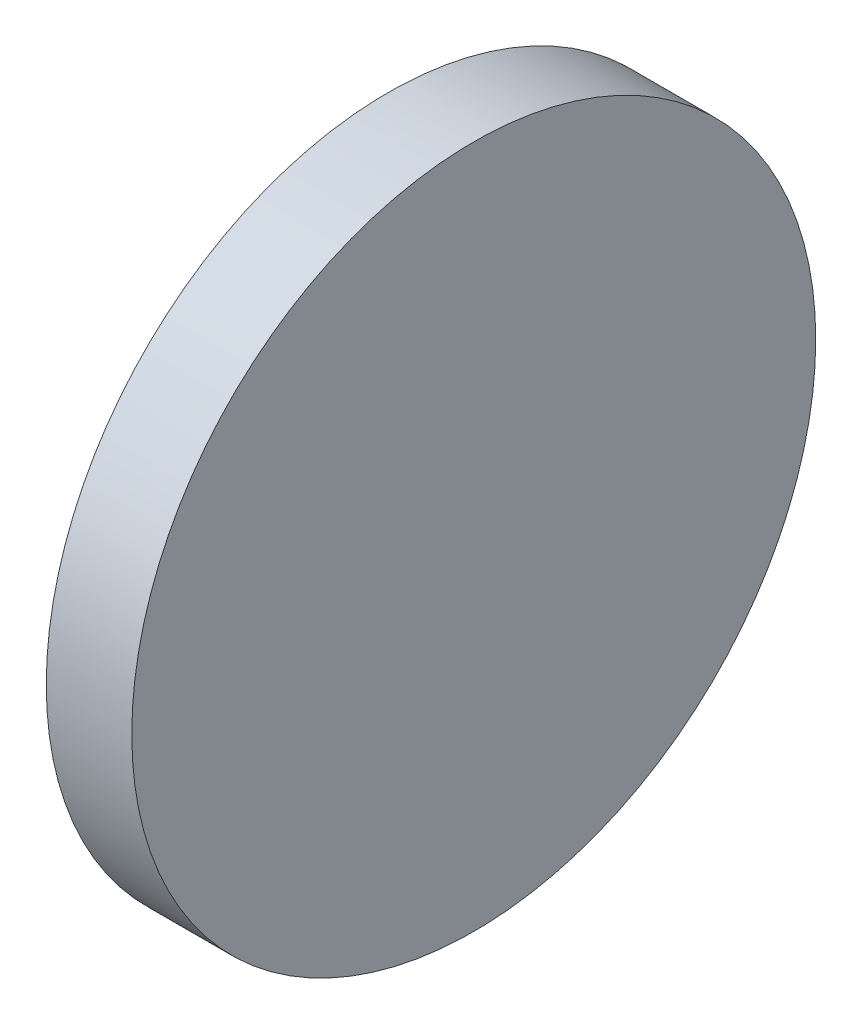
ISO-10303-21;
HEADER;
FILE_DESCRIPTION(('STEP AP214'),'2;1');
FILE_NAME('part.step','',(''),(''),'','','');
FILE_SCHEMA(('AUTOMOTIVE_DESIGN { 1 0 10303 214 1 1 1 1 }'));
ENDSEC;
DATA;
#1=APPLICATION_CONTEXT('core data for automotive mechanical design processes');
#2=APPLICATION_PROTOCOL_DEFINITION('international standard','automotive_design',2000,#1);
#3=PRODUCT_CONTEXT('',#1,'mechanical');
#4=PRODUCT('Part','Part','',(#3));
#5=PRODUCT_RELATED_PRODUCT_CATEGORY('part','',(#4));
#6=PRODUCT_DEFINITION_FORMATION('','',#4);
#7=PRODUCT_DEFINITION_CONTEXT('part definition',#1,'design');
#8=PRODUCT_DEFINITION('design','',#6,#7);
#9=PRODUCT_DEFINITION_SHAPE('','',#8);
#10=(LENGTH_UNIT() NAMED_UNIT(*) SI_UNIT(.MILLI.,.METRE.));
#11=(NAMED_UNIT(*) PLANE_ANGLE_UNIT() SI_UNIT($,.RADIAN.));
#12=(NAMED_UNIT(*) SI_UNIT($,.STERADIAN.) SOLID_ANGLE_UNIT());
#13=UNCERTAINTY_MEASURE_WITH_UNIT(LENGTH_MEASURE(1.E-05),#10,'distance_accuracy_value','');
#14=(GEOMETRIC_REPRESENTATION_CONTEXT(3) GLOBAL_UNCERTAINTY_ASSIGNED_CONTEXT((#13)) GLOBAL_UNIT_ASSIGNED_CONTEXT((#10,
#11,#12)) REPRESENTATION_CONTEXT('',''));
#15=CARTESIAN_POINT('',(0.,0.,0.));
#16=DIRECTION('',(0.,0.,1.));
#17=DIRECTION('',(1.,0.,0.));
#18=AXIS2_PLACEMENT_3D('',#15,#16,#17);
#19=CARTESIAN_POINT('',(5.,0.,0.));
#20=DIRECTION('',(-1.,0.,0.));
#21=DIRECTION('',(0.,0.,1.));
#22=AXIS2_PLACEMENT_3D('',#19,#20,#21);
#23=CYLINDRICAL_SURFACE('',#22,20.);
#24=CARTESIAN_POINT('',(5.,0.,0.));
#25=DIRECTION('',(1.,0.,0.));
#26=DIRECTION('',(0.,0.,-1.));
#27=AXIS2_PLACEMENT_3D('',#24,#25,#26);
#28=CIRCLE('',#27,20.);
#29=CARTESIAN_POINT('',(5.,0.,-20.));
#30=VERTEX_POINT('',#29);
#31=EDGE_CURVE('E10',#30,#30,#28,.T.);
#32=ORIENTED_EDGE('',*,*,#31,.F.);
#33=EDGE_LOOP('',(#32));
#34=FACE_BOUND('',#33,.T.);
#35=CARTESIAN_POINT('',(0.,0.,0.));
#36=DIRECTION('',(1.,0.,0.));
#37=DIRECTION('',(0.,0.,-1.));
#38=AXIS2_PLACEMENT_3D('',#35,#36,#37);
#39=CIRCLE('',#38,20.);
#40=CARTESIAN_POINT('',(0.,0.,-20.));
#41=VERTEX_POINT('',#40);
#42=EDGE_CURVE('E34',#41,#41,#39,.T.);
#43=ORIENTED_EDGE('',*,*,#42,.T.);
#44=EDGE_LOOP('',(#43));
#45=FACE_BOUND('',#44,.T.);
#46=ADVANCED_FACE('F31',(#34,#45),#23,.T.);
#47=CARTESIAN_POINT('',(5.,0.,0.));
#48=DIRECTION('',(1.,0.,0.));
#49=DIRECTION('',(0.,0.,-1.));
#50=AXIS2_PLACEMENT_3D('',#47,#48,#49);
#51=PLANE('',#50);
#52=ORIENTED_EDGE('',*,*,#31,.T.);
#53=EDGE_LOOP('',(#52));
#54=FACE_BOUND('',#53,.T.);
#55=ADVANCED_FACE('F46',(#54),#51,.T.);
#56=CARTESIAN_POINT('',(0.,0.,0.));
#57=DIRECTION('',(1.,0.,0.));
#58=DIRECTION('',(0.,0.,-1.));
#59=AXIS2_PLACEMENT_3D('',#56,#57,#58);
#60=PLANE('',#59);
#61=ORIENTED_EDGE('',*,*,#42,.F.);
#62=EDGE_LOOP('',(#61));
#63=FACE_BOUND('',#62,.T.);
#64=ADVANCED_FACE('F44',(#63),#60,.F.);
#65=CLOSED_SHELL('',(#46,#55,#64));
#66=MANIFOLD_SOLID_BREP('B2',#65);
#67=ADVANCED_BREP_SHAPE_REPRESENTATION('',(#18,#66),#14);
#68=SHAPE_DEFINITION_REPRESENTATION(#9,#67);
ENDSEC;
END-ISO-10303-21;
